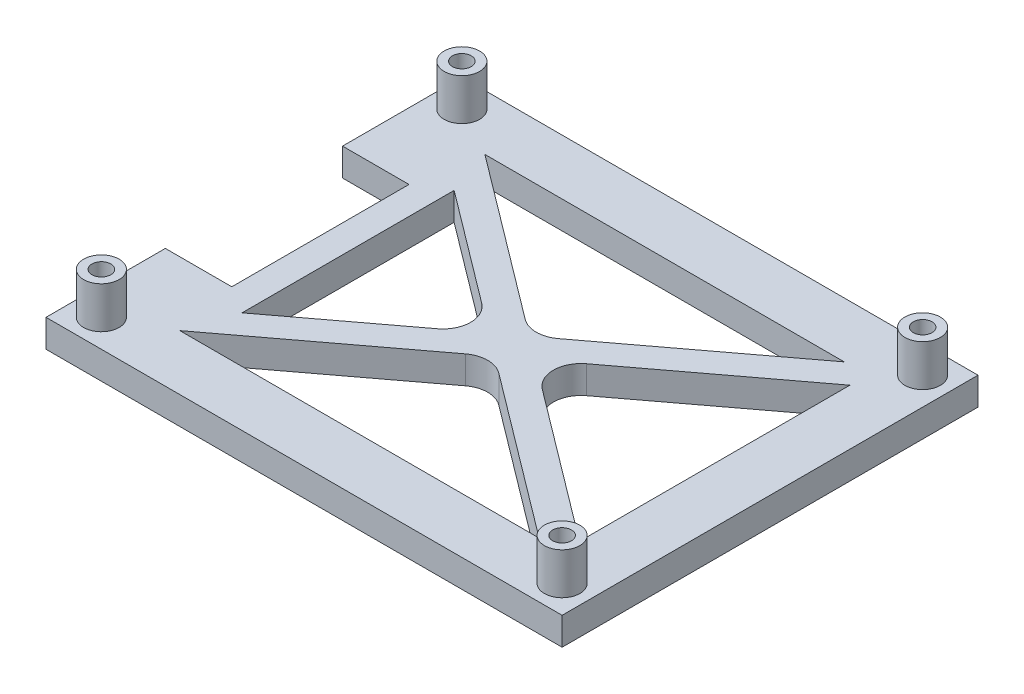
ISO-10303-21;
HEADER;
FILE_DESCRIPTION(('STEP AP214'),'2;1');
FILE_NAME('part.step','',(''),(''),'','','');
FILE_SCHEMA(('AUTOMOTIVE_DESIGN { 1 0 10303 214 1 1 1 1 }'));
ENDSEC;
DATA;
#1=APPLICATION_CONTEXT('core data for automotive mechanical design processes');
#2=APPLICATION_PROTOCOL_DEFINITION('international standard','automotive_design',2000,#1);
#3=PRODUCT_CONTEXT('',#1,'mechanical');
#4=PRODUCT('Part','Part','',(#3));
#5=PRODUCT_RELATED_PRODUCT_CATEGORY('part','',(#4));
#6=PRODUCT_DEFINITION_FORMATION('','',#4);
#7=PRODUCT_DEFINITION_CONTEXT('part definition',#1,'design');
#8=PRODUCT_DEFINITION('design','',#6,#7);
#9=PRODUCT_DEFINITION_SHAPE('','',#8);
#10=(LENGTH_UNIT() NAMED_UNIT(*) SI_UNIT(.MILLI.,.METRE.));
#11=(NAMED_UNIT(*) PLANE_ANGLE_UNIT() SI_UNIT($,.RADIAN.));
#12=(NAMED_UNIT(*) SI_UNIT($,.STERADIAN.) SOLID_ANGLE_UNIT());
#13=UNCERTAINTY_MEASURE_WITH_UNIT(LENGTH_MEASURE(1.E-05),#10,'distance_accuracy_value','');
#14=(GEOMETRIC_REPRESENTATION_CONTEXT(3) GLOBAL_UNCERTAINTY_ASSIGNED_CONTEXT((#13)) GLOBAL_UNIT_ASSIGNED_CONTEXT((#10,
#11,#12)) REPRESENTATION_CONTEXT('',''));
#15=CARTESIAN_POINT('',(0.,0.,0.));
#16=DIRECTION('',(0.,0.,1.));
#17=DIRECTION('',(1.,0.,0.));
#18=AXIS2_PLACEMENT_3D('',#15,#16,#17);
#19=CARTESIAN_POINT('',(-46.6,5.,0.));
#20=DIRECTION('',(-1.,0.,0.));
#21=DIRECTION('',(0.,0.,1.));
#22=AXIS2_PLACEMENT_3D('',#19,#20,#21);
#23=PLANE('',#22);
#24=DIRECTION('',(0.,1.,0.));
#25=VECTOR('',#24,1.);
#26=CARTESIAN_POINT('',(-46.6,0.,-16.));
#27=LINE('',#26,#25);
#28=CARTESIAN_POINT('',(-46.6,0.,-16.));
#29=VERTEX_POINT('',#28);
#30=CARTESIAN_POINT('',(-46.6,5.,-16.));
#31=VERTEX_POINT('',#30);
#32=EDGE_CURVE('E253',#29,#31,#27,.T.);
#33=ORIENTED_EDGE('',*,*,#32,.T.);
#34=DIRECTION('',(0.,0.,-1.));
#35=VECTOR('',#34,1.);
#36=CARTESIAN_POINT('',(-46.6,5.,0.));
#37=LINE('',#36,#35);
#38=CARTESIAN_POINT('',(-46.6,5.,-37.55));
#39=VERTEX_POINT('',#38);
#40=EDGE_CURVE('E217',#31,#39,#37,.T.);
#41=ORIENTED_EDGE('',*,*,#40,.T.);
#42=DIRECTION('',(0.,-1.,0.));
#43=VECTOR('',#42,1.);
#44=CARTESIAN_POINT('',(-46.6,5.,-37.55));
#45=LINE('',#44,#43);
#46=CARTESIAN_POINT('',(-46.6,0.,-37.55));
#47=VERTEX_POINT('',#46);
#48=EDGE_CURVE('E390',#39,#47,#45,.T.);
#49=ORIENTED_EDGE('',*,*,#48,.T.);
#50=DIRECTION('',(0.,0.,-1.));
#51=VECTOR('',#50,1.);
#52=CARTESIAN_POINT('',(-46.6,0.,0.));
#53=LINE('',#52,#51);
#54=EDGE_CURVE('E370',#29,#47,#53,.T.);
#55=ORIENTED_EDGE('',*,*,#54,.F.);
#56=EDGE_LOOP('',(#33,#41,#49,#55));
#57=FACE_BOUND('',#56,.T.);
#58=ADVANCED_FACE('F49',(#57),#23,.T.);
#59=CARTESIAN_POINT('',(0.,5.,0.));
#60=DIRECTION('',(0.,1.,0.));
#61=DIRECTION('',(0.,0.,1.));
#62=AXIS2_PLACEMENT_3D('',#59,#60,#61);
#63=PLANE('',#62);
#64=DIRECTION('',(0.798950975558303,0.,-0.601396157831455));
#65=VECTOR('',#64,1.);
#66=CARTESIAN_POINT('',(-1.50349039457863,5.,-1.99737743889575));
#67=LINE('',#66,#65);
#68=CARTESIAN_POINT('',(-29.6,5.,19.1517711848572));
#69=VERTEX_POINT('',#68);
#70=CARTESIAN_POINT('',(-9.4640001147512,5.,3.99475487779152));
#71=VERTEX_POINT('',#70);
#72=EDGE_CURVE('E309',#69,#71,#67,.T.);
#73=ORIENTED_EDGE('',*,*,#72,.F.);
#74=DIRECTION('',(0.,0.,-1.));
#75=VECTOR('',#74,1.);
#76=CARTESIAN_POINT('',(-29.6,5.,19.1517711848572));
#77=LINE('',#76,#75);
#78=CARTESIAN_POINT('',(-29.6,5.,-19.1517711848572));
#79=VERTEX_POINT('',#78);
#80=EDGE_CURVE('E232',#69,#79,#77,.T.);
#81=ORIENTED_EDGE('',*,*,#80,.T.);
#82=DIRECTION('',(0.798950975558303,0.,0.601396157831455));
#83=VECTOR('',#82,1.);
#84=CARTESIAN_POINT('',(-1.50349039457863,5.,1.99737743889575));
#85=LINE('',#84,#83);
#86=CARTESIAN_POINT('',(-9.4640001147512,5.,-3.99475487779152));
#87=VERTEX_POINT('',#86);
#88=EDGE_CURVE('E311',#79,#87,#85,.T.);
#89=ORIENTED_EDGE('',*,*,#88,.T.);
#90=CARTESIAN_POINT('',(-12.4709809039085,5.,0.));
#91=DIRECTION('',(0.,1.,0.));
#92=DIRECTION('',(0.,0.,1.));
#93=AXIS2_PLACEMENT_3D('',#90,#91,#92);
#94=CIRCLE('',#93,5.);
#95=EDGE_CURVE('E11',#87,#71,#94,.F.);
#96=ORIENTED_EDGE('',*,*,#95,.T.);
#97=EDGE_LOOP('',(#73,#81,#89,#96));
#98=FACE_BOUND('',#97,.T.);
#99=DIRECTION('',(0.,0.,1.));
#100=VECTOR('',#99,1.);
#101=CARTESIAN_POINT('',(-34.6,5.,-16.));
#102=LINE('',#101,#100);
#103=CARTESIAN_POINT('',(-34.6,5.,-16.));
#104=VERTEX_POINT('',#103);
#105=CARTESIAN_POINT('',(-34.6,5.,16.));
#106=VERTEX_POINT('',#105);
#107=EDGE_CURVE('E215',#104,#106,#102,.T.);
#108=ORIENTED_EDGE('',*,*,#107,.T.);
#109=DIRECTION('',(1.,0.,0.));
#110=VECTOR('',#109,1.);
#111=CARTESIAN_POINT('',(-46.6,5.,16.));
#112=LINE('',#111,#110);
#113=CARTESIAN_POINT('',(-46.6,5.,16.));
#114=VERTEX_POINT('',#113);
#115=EDGE_CURVE('E221',#114,#106,#112,.T.);
#116=ORIENTED_EDGE('',*,*,#115,.F.);
#117=CARTESIAN_POINT('',(-46.6,5.,37.55));
#118=VERTEX_POINT('',#117);
#119=EDGE_CURVE('E321',#118,#114,#37,.T.);
#120=ORIENTED_EDGE('',*,*,#119,.F.);
#121=DIRECTION('',(-1.,0.,0.));
#122=VECTOR('',#121,1.);
#123=CARTESIAN_POINT('',(0.,5.,37.55));
#124=LINE('',#123,#122);
#125=CARTESIAN_POINT('',(46.6,5.,37.55));
#126=VERTEX_POINT('',#125);
#127=EDGE_CURVE('E313',#126,#118,#124,.T.);
#128=ORIENTED_EDGE('',*,*,#127,.F.);
#129=DIRECTION('',(0.,0.,-1.));
#130=VECTOR('',#129,1.);
#131=CARTESIAN_POINT('',(46.6,5.,0.));
#132=LINE('',#131,#130);
#133=CARTESIAN_POINT('',(46.6,5.,-37.55));
#134=VERTEX_POINT('',#133);
#135=EDGE_CURVE('E316',#126,#134,#132,.T.);
#136=ORIENTED_EDGE('',*,*,#135,.T.);
#137=DIRECTION('',(-1.,0.,0.));
#138=VECTOR('',#137,1.);
#139=CARTESIAN_POINT('',(0.,5.,-37.55));
#140=LINE('',#139,#138);
#141=EDGE_CURVE('E319',#134,#39,#140,.T.);
#142=ORIENTED_EDGE('',*,*,#141,.T.);
#143=ORIENTED_EDGE('',*,*,#40,.F.);
#144=DIRECTION('',(-1.,0.,0.));
#145=VECTOR('',#144,1.);
#146=CARTESIAN_POINT('',(-46.6,5.,-16.));
#147=LINE('',#146,#145);
#148=EDGE_CURVE('E209',#104,#31,#147,.T.);
#149=ORIENTED_EDGE('',*,*,#148,.F.);
#150=EDGE_LOOP('',(#108,#116,#120,#128,#136,#142,#143,#149));
#151=FACE_BOUND('',#150,.T.);
#152=CARTESIAN_POINT('',(41.6,5.,32.55));
#153=DIRECTION('',(0.,1.,0.));
#154=DIRECTION('',(0.,0.,1.));
#155=AXIS2_PLACEMENT_3D('',#152,#153,#154);
#156=CIRCLE('',#155,3.2);
#157=CARTESIAN_POINT('',(41.6,5.,35.75));
#158=VERTEX_POINT('',#157);
#159=EDGE_CURVE('E266',#158,#158,#156,.T.);
#160=ORIENTED_EDGE('',*,*,#159,.F.);
#161=EDGE_LOOP('',(#160));
#162=FACE_BOUND('',#161,.T.);
#163=CARTESIAN_POINT('',(-41.6,5.,-32.55));
#164=DIRECTION('',(0.,1.,0.));
#165=DIRECTION('',(0.,0.,1.));
#166=AXIS2_PLACEMENT_3D('',#163,#164,#165);
#167=CIRCLE('',#166,3.2);
#168=CARTESIAN_POINT('',(-41.6,5.,-29.35));
#169=VERTEX_POINT('',#168);
#170=EDGE_CURVE('E286',#169,#169,#167,.T.);
#171=ORIENTED_EDGE('',*,*,#170,.F.);
#172=EDGE_LOOP('',(#171));
#173=FACE_BOUND('',#172,.T.);
#174=DIRECTION('',(0.798950975558303,0.,-0.601396157831455));
#175=VECTOR('',#174,1.);
#176=CARTESIAN_POINT('',(-1.50349039457863,5.,-1.99737743889575));
#177=LINE('',#176,#175);
#178=CARTESIAN_POINT('',(3.00698078915729,5.,-5.39255451845654));
#179=VERTEX_POINT('',#178);
#180=CARTESIAN_POINT('',(32.4430063653638,5.,-27.55));
#181=VERTEX_POINT('',#180);
#182=EDGE_CURVE('E293',#179,#181,#177,.T.);
#183=ORIENTED_EDGE('',*,*,#182,.F.);
#184=CARTESIAN_POINT('',(0.,5.,-9.38730939624805));
#185=DIRECTION('',(0.,1.,0.));
#186=DIRECTION('',(0.,0.,1.));
#187=AXIS2_PLACEMENT_3D('',#184,#185,#186);
#188=CIRCLE('',#187,5.);
#189=CARTESIAN_POINT('',(-3.00698078915725,5.,-5.39255451845654));
#190=VERTEX_POINT('',#189);
#191=EDGE_CURVE('E428',#179,#190,#188,.F.);
#192=ORIENTED_EDGE('',*,*,#191,.T.);
#193=DIRECTION('',(0.798950975558303,0.,0.601396157831455));
#194=VECTOR('',#193,1.);
#195=CARTESIAN_POINT('',(1.50349039457865,5.,-1.99737743889577));
#196=LINE('',#195,#194);
#197=CARTESIAN_POINT('',(-32.4430063653638,5.,-27.55));
#198=VERTEX_POINT('',#197);
#199=EDGE_CURVE('E295',#198,#190,#196,.T.);
#200=ORIENTED_EDGE('',*,*,#199,.F.);
#201=DIRECTION('',(-1.,0.,0.));
#202=VECTOR('',#201,1.);
#203=CARTESIAN_POINT('',(0.,5.,-27.55));
#204=LINE('',#203,#202);
#205=EDGE_CURVE('E299',#181,#198,#204,.T.);
#206=ORIENTED_EDGE('',*,*,#205,.F.);
#207=EDGE_LOOP('',(#183,#192,#200,#206));
#208=FACE_BOUND('',#207,.T.);
#209=DIRECTION('',(0.798950975558303,0.,0.601396157831455));
#210=VECTOR('',#209,1.);
#211=CARTESIAN_POINT('',(1.50349039457864,5.,-1.99737743889577));
#212=LINE('',#211,#210);
#213=CARTESIAN_POINT('',(9.46400011475122,5.,3.99475487779152));
#214=VERTEX_POINT('',#213);
#215=CARTESIAN_POINT('',(36.6,5.,24.4208968679173));
#216=VERTEX_POINT('',#215);
#217=EDGE_CURVE('E302',#214,#216,#212,.T.);
#218=ORIENTED_EDGE('',*,*,#217,.F.);
#219=CARTESIAN_POINT('',(12.4709809039085,5.,0.));
#220=DIRECTION('',(0.,1.,0.));
#221=DIRECTION('',(0.,0.,1.));
#222=AXIS2_PLACEMENT_3D('',#219,#220,#221);
#223=CIRCLE('',#222,5.);
#224=CARTESIAN_POINT('',(9.46400011475122,5.,-3.99475487779152));
#225=VERTEX_POINT('',#224);
#226=EDGE_CURVE('E436',#214,#225,#223,.F.);
#227=ORIENTED_EDGE('',*,*,#226,.T.);
#228=DIRECTION('',(0.798950975558303,0.,-0.601396157831455));
#229=VECTOR('',#228,1.);
#230=CARTESIAN_POINT('',(1.50349039457864,5.,1.99737743889576));
#231=LINE('',#230,#229);
#232=CARTESIAN_POINT('',(36.6,5.,-24.4208968679173));
#233=VERTEX_POINT('',#232);
#234=EDGE_CURVE('E304',#225,#233,#231,.T.);
#235=ORIENTED_EDGE('',*,*,#234,.T.);
#236=DIRECTION('',(0.,0.,-1.));
#237=VECTOR('',#236,1.);
#238=CARTESIAN_POINT('',(36.6,5.,0.));
#239=LINE('',#238,#237);
#240=EDGE_CURVE('E306',#216,#233,#239,.T.);
#241=ORIENTED_EDGE('',*,*,#240,.F.);
#242=EDGE_LOOP('',(#218,#227,#235,#241));
#243=FACE_BOUND('',#242,.T.);
#244=DIRECTION('',(0.798950975558303,0.,-0.601396157831455));
#245=VECTOR('',#244,1.);
#246=CARTESIAN_POINT('',(1.50349039457864,5.,1.99737743889576));
#247=LINE('',#246,#245);
#248=CARTESIAN_POINT('',(-32.4430063653638,5.,27.55));
#249=VERTEX_POINT('',#248);
#250=CARTESIAN_POINT('',(-3.00698078915727,5.,5.39255451845653));
#251=VERTEX_POINT('',#250);
#252=EDGE_CURVE('E324',#249,#251,#247,.T.);
#253=ORIENTED_EDGE('',*,*,#252,.T.);
#254=CARTESIAN_POINT('',(0.,5.,9.38730939624804));
#255=DIRECTION('',(0.,1.,0.));
#256=DIRECTION('',(0.,0.,1.));
#257=AXIS2_PLACEMENT_3D('',#254,#255,#256);
#258=CIRCLE('',#257,5.);
#259=CARTESIAN_POINT('',(3.00698078915728,5.,5.39255451845653));
#260=VERTEX_POINT('',#259);
#261=EDGE_CURVE('E432',#251,#260,#258,.F.);
#262=ORIENTED_EDGE('',*,*,#261,.T.);
#263=DIRECTION('',(0.798950975558303,0.,0.601396157831455));
#264=VECTOR('',#263,1.);
#265=CARTESIAN_POINT('',(-1.50349039457863,5.,1.99737743889576));
#266=LINE('',#265,#264);
#267=CARTESIAN_POINT('',(32.4430063653639,5.,27.55));
#268=VERTEX_POINT('',#267);
#269=EDGE_CURVE('E327',#260,#268,#266,.T.);
#270=ORIENTED_EDGE('',*,*,#269,.T.);
#271=DIRECTION('',(-1.,0.,0.));
#272=VECTOR('',#271,1.);
#273=CARTESIAN_POINT('',(0.,5.,27.55));
#274=LINE('',#273,#272);
#275=EDGE_CURVE('E329',#268,#249,#274,.T.);
#276=ORIENTED_EDGE('',*,*,#275,.T.);
#277=EDGE_LOOP('',(#253,#262,#270,#276));
#278=FACE_BOUND('',#277,.T.);
#279=CARTESIAN_POINT('',(41.6,5.,-32.55));
#280=DIRECTION('',(0.,1.,0.));
#281=DIRECTION('',(0.,0.,1.));
#282=AXIS2_PLACEMENT_3D('',#279,#280,#281);
#283=CIRCLE('',#282,3.2);
#284=CARTESIAN_POINT('',(41.6,5.,-29.35));
#285=VERTEX_POINT('',#284);
#286=EDGE_CURVE('E275',#285,#285,#283,.T.);
#287=ORIENTED_EDGE('',*,*,#286,.F.);
#288=EDGE_LOOP('',(#287));
#289=FACE_BOUND('',#288,.T.);
#290=CARTESIAN_POINT('',(-41.6,5.,32.55));
#291=DIRECTION('',(0.,1.,0.));
#292=DIRECTION('',(0.,0.,1.));
#293=AXIS2_PLACEMENT_3D('',#290,#291,#292);
#294=CIRCLE('',#293,3.2);
#295=CARTESIAN_POINT('',(-41.6,5.,35.75));
#296=VERTEX_POINT('',#295);
#297=EDGE_CURVE('E257',#296,#296,#294,.T.);
#298=ORIENTED_EDGE('',*,*,#297,.F.);
#299=EDGE_LOOP('',(#298));
#300=FACE_BOUND('',#299,.T.);
#301=ADVANCED_FACE('F211',(#98,#151,#162,#173,#208,#243,#278,#289,#300),#63,.T.);
#302=CARTESIAN_POINT('',(1.50349039457864,5.,1.99737743889576));
#303=DIRECTION('',(-0.601396157831455,0.,-0.798950975558303));
#304=DIRECTION('',(-0.798950975558303,0.,0.601396157831455));
#305=AXIS2_PLACEMENT_3D('',#302,#303,#304);
#306=PLANE('',#305);
#307=DIRECTION('',(0.798950975558303,0.,-0.601396157831455));
#308=VECTOR('',#307,1.);
#309=CARTESIAN_POINT('',(1.50349039457864,0.,1.99737743889576));
#310=LINE('',#309,#308);
#311=CARTESIAN_POINT('',(-32.4430063653638,0.,27.55));
#312=VERTEX_POINT('',#311);
#313=CARTESIAN_POINT('',(-3.00698078915727,0.,5.39255451845653));
#314=VERTEX_POINT('',#313);
#315=EDGE_CURVE('E374',#312,#314,#310,.T.);
#316=ORIENTED_EDGE('',*,*,#315,.T.);
#317=DIRECTION('',(0.,-1.,0.));
#318=VECTOR('',#317,1.);
#319=CARTESIAN_POINT('',(-3.00698078915727,5.,5.39255451845653));
#320=LINE('',#319,#318);
#321=EDGE_CURVE('E414',#314,#251,#320,.F.);
#322=ORIENTED_EDGE('',*,*,#321,.T.);
#323=ORIENTED_EDGE('',*,*,#252,.F.);
#324=DIRECTION('',(0.,-1.,0.));
#325=VECTOR('',#324,1.);
#326=CARTESIAN_POINT('',(-32.4430063653638,5.,27.55));
#327=LINE('',#326,#325);
#328=EDGE_CURVE('E380',#249,#312,#327,.T.);
#329=ORIENTED_EDGE('',*,*,#328,.T.);
#330=EDGE_LOOP('',(#316,#322,#323,#329));
#331=FACE_BOUND('',#330,.T.);
#332=ADVANCED_FACE('F482',(#331),#306,.F.);
#333=CARTESIAN_POINT('',(-1.50349039457863,5.,1.99737743889576));
#334=DIRECTION('',(0.601396157831455,0.,-0.798950975558303));
#335=DIRECTION('',(-0.798950975558303,0.,-0.601396157831455));
#336=AXIS2_PLACEMENT_3D('',#333,#334,#335);
#337=PLANE('',#336);
#338=ORIENTED_EDGE('',*,*,#269,.F.);
#339=DIRECTION('',(0.,-1.,0.));
#340=VECTOR('',#339,1.);
#341=CARTESIAN_POINT('',(3.00698078915728,0.,5.39255451845653));
#342=LINE('',#341,#340);
#343=CARTESIAN_POINT('',(3.00698078915728,0.,5.39255451845653));
#344=VERTEX_POINT('',#343);
#345=EDGE_CURVE('E411',#260,#344,#342,.T.);
#346=ORIENTED_EDGE('',*,*,#345,.T.);
#347=DIRECTION('',(0.798950975558303,0.,0.601396157831455));
#348=VECTOR('',#347,1.);
#349=CARTESIAN_POINT('',(-1.50349039457863,0.,1.99737743889576));
#350=LINE('',#349,#348);
#351=CARTESIAN_POINT('',(32.4430063653639,0.,27.55));
#352=VERTEX_POINT('',#351);
#353=EDGE_CURVE('E377',#344,#352,#350,.T.);
#354=ORIENTED_EDGE('',*,*,#353,.T.);
#355=DIRECTION('',(0.,-1.,0.));
#356=VECTOR('',#355,1.);
#357=CARTESIAN_POINT('',(32.4430063653639,5.,27.55));
#358=LINE('',#357,#356);
#359=EDGE_CURVE('E383',#268,#352,#358,.T.);
#360=ORIENTED_EDGE('',*,*,#359,.F.);
#361=EDGE_LOOP('',(#338,#346,#354,#360));
#362=FACE_BOUND('',#361,.T.);
#363=ADVANCED_FACE('F553',(#362),#337,.F.);
#364=CARTESIAN_POINT('',(0.,5.,37.55));
#365=DIRECTION('',(0.,0.,1.));
#366=DIRECTION('',(1.,0.,0.));
#367=AXIS2_PLACEMENT_3D('',#364,#365,#366);
#368=PLANE('',#367);
#369=DIRECTION('',(-1.,0.,0.));
#370=VECTOR('',#369,1.);
#371=CARTESIAN_POINT('',(0.,0.,37.55));
#372=LINE('',#371,#370);
#373=CARTESIAN_POINT('',(46.6,0.,37.55));
#374=VERTEX_POINT('',#373);
#375=CARTESIAN_POINT('',(-46.6,0.,37.55));
#376=VERTEX_POINT('',#375);
#377=EDGE_CURVE('E361',#374,#376,#372,.T.);
#378=ORIENTED_EDGE('',*,*,#377,.F.);
#379=DIRECTION('',(0.,-1.,0.));
#380=VECTOR('',#379,1.);
#381=CARTESIAN_POINT('',(46.6,5.,37.55));
#382=LINE('',#381,#380);
#383=EDGE_CURVE('E384',#126,#374,#382,.T.);
#384=ORIENTED_EDGE('',*,*,#383,.F.);
#385=ORIENTED_EDGE('',*,*,#127,.T.);
#386=DIRECTION('',(0.,-1.,0.));
#387=VECTOR('',#386,1.);
#388=CARTESIAN_POINT('',(-46.6,5.,37.55));
#389=LINE('',#388,#387);
#390=EDGE_CURVE('E388',#118,#376,#389,.T.);
#391=ORIENTED_EDGE('',*,*,#390,.T.);
#392=EDGE_LOOP('',(#378,#384,#385,#391));
#393=FACE_BOUND('',#392,.T.);
#394=ADVANCED_FACE('F502',(#393),#368,.T.);
#395=CARTESIAN_POINT('',(46.6,5.,0.));
#396=DIRECTION('',(-1.,0.,0.));
#397=DIRECTION('',(0.,0.,1.));
#398=AXIS2_PLACEMENT_3D('',#395,#396,#397);
#399=PLANE('',#398);
#400=DIRECTION('',(0.,0.,-1.));
#401=VECTOR('',#400,1.);
#402=CARTESIAN_POINT('',(46.6,0.,0.));
#403=LINE('',#402,#401);
#404=CARTESIAN_POINT('',(46.6,0.,-37.55));
#405=VERTEX_POINT('',#404);
#406=EDGE_CURVE('E364',#374,#405,#403,.T.);
#407=ORIENTED_EDGE('',*,*,#406,.T.);
#408=DIRECTION('',(0.,-1.,0.));
#409=VECTOR('',#408,1.);
#410=CARTESIAN_POINT('',(46.6,5.,-37.55));
#411=LINE('',#410,#409);
#412=EDGE_CURVE('E394',#134,#405,#411,.T.);
#413=ORIENTED_EDGE('',*,*,#412,.F.);
#414=ORIENTED_EDGE('',*,*,#135,.F.);
#415=ORIENTED_EDGE('',*,*,#383,.T.);
#416=EDGE_LOOP('',(#407,#413,#414,#415));
#417=FACE_BOUND('',#416,.T.);
#418=ADVANCED_FACE('F469',(#417),#399,.F.);
#419=CARTESIAN_POINT('',(0.,5.,-37.55));
#420=DIRECTION('',(0.,0.,1.));
#421=DIRECTION('',(1.,0.,0.));
#422=AXIS2_PLACEMENT_3D('',#419,#420,#421);
#423=PLANE('',#422);
#424=DIRECTION('',(-1.,0.,0.));
#425=VECTOR('',#424,1.);
#426=CARTESIAN_POINT('',(0.,0.,-37.55));
#427=LINE('',#426,#425);
#428=EDGE_CURVE('E367',#405,#47,#427,.T.);
#429=ORIENTED_EDGE('',*,*,#428,.T.);
#430=ORIENTED_EDGE('',*,*,#48,.F.);
#431=ORIENTED_EDGE('',*,*,#141,.F.);
#432=ORIENTED_EDGE('',*,*,#412,.T.);
#433=EDGE_LOOP('',(#429,#430,#431,#432));
#434=FACE_BOUND('',#433,.T.);
#435=ADVANCED_FACE('F458',(#434),#423,.F.);
#436=CARTESIAN_POINT('',(-1.50349039457863,5.,-1.99737743889575));
#437=DIRECTION('',(-0.601396157831455,0.,-0.798950975558303));
#438=DIRECTION('',(-0.798950975558303,0.,0.601396157831455));
#439=AXIS2_PLACEMENT_3D('',#436,#437,#438);
#440=PLANE('',#439);
#441=DIRECTION('',(0.,1.,0.));
#442=VECTOR('',#441,1.);
#443=CARTESIAN_POINT('',(-29.6,-49.3408635446707,19.1517711848572));
#444=LINE('',#443,#442);
#445=CARTESIAN_POINT('',(-29.6,0.,19.1517711848572));
#446=VERTEX_POINT('',#445);
#447=EDGE_CURVE('E64',#446,#69,#444,.T.);
#448=ORIENTED_EDGE('',*,*,#447,.T.);
#449=ORIENTED_EDGE('',*,*,#72,.T.);
#450=DIRECTION('',(0.,-1.,0.));
#451=VECTOR('',#450,1.);
#452=CARTESIAN_POINT('',(-9.4640001147512,5.,3.99475487779151));
#453=LINE('',#452,#451);
#454=CARTESIAN_POINT('',(-9.4640001147512,0.,3.99475487779152));
#455=VERTEX_POINT('',#454);
#456=EDGE_CURVE('E421',#71,#455,#453,.T.);
#457=ORIENTED_EDGE('',*,*,#456,.T.);
#458=DIRECTION('',(0.798950975558303,0.,-0.601396157831455));
#459=VECTOR('',#458,1.);
#460=CARTESIAN_POINT('',(-1.50349039457863,0.,-1.99737743889575));
#461=LINE('',#460,#459);
#462=EDGE_CURVE('E69',#446,#455,#461,.T.);
#463=ORIENTED_EDGE('',*,*,#462,.F.);
#464=EDGE_LOOP('',(#448,#449,#457,#463));
#465=FACE_BOUND('',#464,.T.);
#466=ADVANCED_FACE('F455',(#465),#440,.T.);
#467=CARTESIAN_POINT('',(1.50349039457864,5.,-1.99737743889577));
#468=DIRECTION('',(0.601396157831455,0.,-0.798950975558303));
#469=DIRECTION('',(-0.798950975558303,0.,-0.601396157831455));
#470=AXIS2_PLACEMENT_3D('',#467,#468,#469);
#471=PLANE('',#470);
#472=DIRECTION('',(0.798950975558303,0.,0.601396157831455));
#473=VECTOR('',#472,1.);
#474=CARTESIAN_POINT('',(1.50349039457864,0.,-1.99737743889577));
#475=LINE('',#474,#473);
#476=CARTESIAN_POINT('',(9.46400011475122,0.,3.99475487779152));
#477=VERTEX_POINT('',#476);
#478=CARTESIAN_POINT('',(36.6,0.,24.4208968679173));
#479=VERTEX_POINT('',#478);
#480=EDGE_CURVE('E351',#477,#479,#475,.T.);
#481=ORIENTED_EDGE('',*,*,#480,.F.);
#482=DIRECTION('',(0.,-1.,0.));
#483=VECTOR('',#482,1.);
#484=CARTESIAN_POINT('',(9.46400011475122,5.,3.99475487779151));
#485=LINE('',#484,#483);
#486=EDGE_CURVE('E419',#477,#214,#485,.F.);
#487=ORIENTED_EDGE('',*,*,#486,.T.);
#488=ORIENTED_EDGE('',*,*,#217,.T.);
#489=DIRECTION('',(0.,-1.,0.));
#490=VECTOR('',#489,1.);
#491=CARTESIAN_POINT('',(36.6,5.,24.4208968679173));
#492=LINE('',#491,#490);
#493=EDGE_CURVE('E398',#216,#479,#492,.T.);
#494=ORIENTED_EDGE('',*,*,#493,.T.);
#495=EDGE_LOOP('',(#481,#487,#488,#494));
#496=FACE_BOUND('',#495,.T.);
#497=ADVANCED_FACE('F457',(#496),#471,.T.);
#498=CARTESIAN_POINT('',(1.50349039457864,5.,1.99737743889576));
#499=DIRECTION('',(-0.601396157831455,0.,-0.798950975558303));
#500=DIRECTION('',(-0.798950975558303,0.,0.601396157831454));
#501=AXIS2_PLACEMENT_3D('',#498,#499,#500);
#502=PLANE('',#501);
#503=ORIENTED_EDGE('',*,*,#234,.F.);
#504=DIRECTION('',(0.,-1.,0.));
#505=VECTOR('',#504,1.);
#506=CARTESIAN_POINT('',(9.46400011475122,5.,-3.99475487779152));
#507=LINE('',#506,#505);
#508=CARTESIAN_POINT('',(9.46400011475122,0.,-3.99475487779152));
#509=VERTEX_POINT('',#508);
#510=EDGE_CURVE('E416',#225,#509,#507,.T.);
#511=ORIENTED_EDGE('',*,*,#510,.T.);
#512=DIRECTION('',(0.798950975558303,0.,-0.601396157831455));
#513=VECTOR('',#512,1.);
#514=CARTESIAN_POINT('',(1.50349039457864,0.,1.99737743889576));
#515=LINE('',#514,#513);
#516=CARTESIAN_POINT('',(36.6,0.,-24.4208968679173));
#517=VERTEX_POINT('',#516);
#518=EDGE_CURVE('E353',#509,#517,#515,.T.);
#519=ORIENTED_EDGE('',*,*,#518,.T.);
#520=DIRECTION('',(0.,-1.,0.));
#521=VECTOR('',#520,1.);
#522=CARTESIAN_POINT('',(36.6,5.,-24.4208968679173));
#523=LINE('',#522,#521);
#524=EDGE_CURVE('E391',#233,#517,#523,.T.);
#525=ORIENTED_EDGE('',*,*,#524,.F.);
#526=EDGE_LOOP('',(#503,#511,#519,#525));
#527=FACE_BOUND('',#526,.T.);
#528=ADVANCED_FACE('F465',(#527),#502,.F.);
#529=CARTESIAN_POINT('',(-1.50349039457863,5.,-1.99737743889575));
#530=DIRECTION('',(-0.601396157831455,0.,-0.798950975558303));
#531=DIRECTION('',(-0.798950975558303,0.,0.601396157831455));
#532=AXIS2_PLACEMENT_3D('',#529,#530,#531);
#533=PLANE('',#532);
#534=DIRECTION('',(0.798950975558303,0.,-0.601396157831455));
#535=VECTOR('',#534,1.);
#536=CARTESIAN_POINT('',(-1.50349039457863,0.,-1.99737743889575));
#537=LINE('',#536,#535);
#538=CARTESIAN_POINT('',(3.00698078915729,0.,-5.39255451845654));
#539=VERTEX_POINT('',#538);
#540=CARTESIAN_POINT('',(32.4430063653638,0.,-27.55));
#541=VERTEX_POINT('',#540);
#542=EDGE_CURVE('E343',#539,#541,#537,.T.);
#543=ORIENTED_EDGE('',*,*,#542,.F.);
#544=DIRECTION('',(0.,-1.,0.));
#545=VECTOR('',#544,1.);
#546=CARTESIAN_POINT('',(3.00698078915729,5.,-5.39255451845654));
#547=LINE('',#546,#545);
#548=EDGE_CURVE('E409',#539,#179,#547,.F.);
#549=ORIENTED_EDGE('',*,*,#548,.T.);
#550=ORIENTED_EDGE('',*,*,#182,.T.);
#551=DIRECTION('',(0.,-1.,0.));
#552=VECTOR('',#551,1.);
#553=CARTESIAN_POINT('',(32.4430063653638,5.,-27.55));
#554=LINE('',#553,#552);
#555=EDGE_CURVE('E331',#181,#541,#554,.T.);
#556=ORIENTED_EDGE('',*,*,#555,.T.);
#557=EDGE_LOOP('',(#543,#549,#550,#556));
#558=FACE_BOUND('',#557,.T.);
#559=ADVANCED_FACE('F491',(#558),#533,.T.);
#560=CARTESIAN_POINT('',(1.50349039457865,5.,-1.99737743889577));
#561=DIRECTION('',(0.601396157831455,0.,-0.798950975558303));
#562=DIRECTION('',(-0.798950975558303,0.,-0.601396157831455));
#563=AXIS2_PLACEMENT_3D('',#560,#561,#562);
#564=PLANE('',#563);
#565=ORIENTED_EDGE('',*,*,#199,.T.);
#566=DIRECTION('',(0.,-1.,0.));
#567=VECTOR('',#566,1.);
#568=CARTESIAN_POINT('',(-3.00698078915726,0.,-5.39255451845654));
#569=LINE('',#568,#567);
#570=CARTESIAN_POINT('',(-3.00698078915725,0.,-5.39255451845654));
#571=VERTEX_POINT('',#570);
#572=EDGE_CURVE('E387',#190,#571,#569,.T.);
#573=ORIENTED_EDGE('',*,*,#572,.T.);
#574=DIRECTION('',(0.798950975558303,0.,0.601396157831455));
#575=VECTOR('',#574,1.);
#576=CARTESIAN_POINT('',(1.50349039457865,0.,-1.99737743889577));
#577=LINE('',#576,#575);
#578=CARTESIAN_POINT('',(-32.4430063653638,0.,-27.55));
#579=VERTEX_POINT('',#578);
#580=EDGE_CURVE('E345',#579,#571,#577,.T.);
#581=ORIENTED_EDGE('',*,*,#580,.F.);
#582=DIRECTION('',(0.,-1.,0.));
#583=VECTOR('',#582,1.);
#584=CARTESIAN_POINT('',(-32.4430063653638,5.,-27.55));
#585=LINE('',#584,#583);
#586=EDGE_CURVE('E401',#198,#579,#585,.T.);
#587=ORIENTED_EDGE('',*,*,#586,.F.);
#588=EDGE_LOOP('',(#565,#573,#581,#587));
#589=FACE_BOUND('',#588,.T.);
#590=ADVANCED_FACE('F485',(#589),#564,.T.);
#591=DIRECTION('',(0.,1.,0.));
#592=VECTOR('',#591,1.);
#593=CARTESIAN_POINT('',(-46.6,0.,16.));
#594=LINE('',#593,#592);
#595=CARTESIAN_POINT('',(-46.6,0.,16.));
#596=VERTEX_POINT('',#595);
#597=EDGE_CURVE('E251',#596,#114,#594,.T.);
#598=ORIENTED_EDGE('',*,*,#597,.F.);
#599=EDGE_CURVE('E371',#376,#596,#53,.T.);
#600=ORIENTED_EDGE('',*,*,#599,.F.);
#601=ORIENTED_EDGE('',*,*,#390,.F.);
#602=ORIENTED_EDGE('',*,*,#119,.T.);
#603=EDGE_LOOP('',(#598,#600,#601,#602));
#604=FACE_BOUND('',#603,.T.);
#605=ADVANCED_FACE('F477',(#604),#23,.T.);
#606=CARTESIAN_POINT('',(-1.50349039457863,5.,1.99737743889575));
#607=DIRECTION('',(0.601396157831455,0.,-0.798950975558303));
#608=DIRECTION('',(-0.798950975558303,0.,-0.601396157831455));
#609=AXIS2_PLACEMENT_3D('',#606,#607,#608);
#610=PLANE('',#609);
#611=ORIENTED_EDGE('',*,*,#88,.F.);
#612=DIRECTION('',(0.,1.,0.));
#613=VECTOR('',#612,1.);
#614=CARTESIAN_POINT('',(-29.6,-49.3408635446707,-19.1517711848572));
#615=LINE('',#614,#613);
#616=CARTESIAN_POINT('',(-29.6,0.,-19.1517711848572));
#617=VERTEX_POINT('',#616);
#618=EDGE_CURVE('E244',#617,#79,#615,.T.);
#619=ORIENTED_EDGE('',*,*,#618,.F.);
#620=DIRECTION('',(0.798950975558303,0.,0.601396157831455));
#621=VECTOR('',#620,1.);
#622=CARTESIAN_POINT('',(-1.50349039457863,0.,1.99737743889575));
#623=LINE('',#622,#621);
#624=CARTESIAN_POINT('',(-9.4640001147512,0.,-3.99475487779152));
#625=VERTEX_POINT('',#624);
#626=EDGE_CURVE('E359',#617,#625,#623,.T.);
#627=ORIENTED_EDGE('',*,*,#626,.T.);
#628=DIRECTION('',(0.,-1.,0.));
#629=VECTOR('',#628,1.);
#630=CARTESIAN_POINT('',(-9.4640001147512,5.,-3.99475487779152));
#631=LINE('',#630,#629);
#632=EDGE_CURVE('E423',#625,#87,#631,.F.);
#633=ORIENTED_EDGE('',*,*,#632,.T.);
#634=EDGE_LOOP('',(#611,#619,#627,#633));
#635=FACE_BOUND('',#634,.T.);
#636=ADVANCED_FACE('F449',(#635),#610,.F.);
#637=CARTESIAN_POINT('',(36.6,5.,0.));
#638=DIRECTION('',(-1.,0.,0.));
#639=DIRECTION('',(0.,0.,1.));
#640=AXIS2_PLACEMENT_3D('',#637,#638,#639);
#641=PLANE('',#640);
#642=DIRECTION('',(0.,0.,-1.));
#643=VECTOR('',#642,1.);
#644=CARTESIAN_POINT('',(36.6,0.,0.));
#645=LINE('',#644,#643);
#646=EDGE_CURVE('E355',#479,#517,#645,.T.);
#647=ORIENTED_EDGE('',*,*,#646,.F.);
#648=ORIENTED_EDGE('',*,*,#493,.F.);
#649=ORIENTED_EDGE('',*,*,#240,.T.);
#650=ORIENTED_EDGE('',*,*,#524,.T.);
#651=EDGE_LOOP('',(#647,#648,#649,#650));
#652=FACE_BOUND('',#651,.T.);
#653=ADVANCED_FACE('F489',(#652),#641,.T.);
#654=CARTESIAN_POINT('',(0.,5.,-27.55));
#655=DIRECTION('',(0.,0.,1.));
#656=DIRECTION('',(1.,0.,0.));
#657=AXIS2_PLACEMENT_3D('',#654,#655,#656);
#658=PLANE('',#657);
#659=DIRECTION('',(-1.,0.,0.));
#660=VECTOR('',#659,1.);
#661=CARTESIAN_POINT('',(0.,0.,-27.55));
#662=LINE('',#661,#660);
#663=EDGE_CURVE('E348',#541,#579,#662,.T.);
#664=ORIENTED_EDGE('',*,*,#663,.F.);
#665=ORIENTED_EDGE('',*,*,#555,.F.);
#666=ORIENTED_EDGE('',*,*,#205,.T.);
#667=ORIENTED_EDGE('',*,*,#586,.T.);
#668=EDGE_LOOP('',(#664,#665,#666,#667));
#669=FACE_BOUND('',#668,.T.);
#670=ADVANCED_FACE('F606',(#669),#658,.T.);
#671=CARTESIAN_POINT('',(-41.6,5.,-32.55));
#672=DIRECTION('',(0.,-1.,0.));
#673=DIRECTION('',(0.,0.,-1.));
#674=AXIS2_PLACEMENT_3D('',#671,#672,#673);
#675=CYLINDRICAL_SURFACE('',#674,1.7);
#676=CARTESIAN_POINT('',(-41.6,0.,-32.55));
#677=DIRECTION('',(0.,1.,0.));
#678=DIRECTION('',(0.,0.,1.));
#679=AXIS2_PLACEMENT_3D('',#676,#677,#678);
#680=CIRCLE('',#679,1.7);
#681=CARTESIAN_POINT('',(-41.6,0.,-30.85));
#682=VERTEX_POINT('',#681);
#683=EDGE_CURVE('E340',#682,#682,#680,.T.);
#684=ORIENTED_EDGE('',*,*,#683,.F.);
#685=EDGE_LOOP('',(#684));
#686=FACE_BOUND('',#685,.T.);
#687=CARTESIAN_POINT('',(-41.6,12.5,-32.55));
#688=DIRECTION('',(0.,1.,0.));
#689=DIRECTION('',(0.,0.,1.));
#690=AXIS2_PLACEMENT_3D('',#687,#688,#689);
#691=CIRCLE('',#690,1.7);
#692=CARTESIAN_POINT('',(-41.6,12.5,-30.85));
#693=VERTEX_POINT('',#692);
#694=EDGE_CURVE('E283',#693,#693,#691,.T.);
#695=ORIENTED_EDGE('',*,*,#694,.T.);
#696=EDGE_LOOP('',(#695));
#697=FACE_BOUND('',#696,.T.);
#698=ADVANCED_FACE('F602',(#686,#697),#675,.F.);
#699=CARTESIAN_POINT('',(41.6,5.,-32.55));
#700=DIRECTION('',(0.,-1.,0.));
#701=DIRECTION('',(0.,0.,-1.));
#702=AXIS2_PLACEMENT_3D('',#699,#700,#701);
#703=CYLINDRICAL_SURFACE('',#702,1.7);
#704=CARTESIAN_POINT('',(41.6,0.,-32.55));
#705=DIRECTION('',(0.,1.,0.));
#706=DIRECTION('',(0.,0.,1.));
#707=AXIS2_PLACEMENT_3D('',#704,#705,#706);
#708=CIRCLE('',#707,1.7);
#709=CARTESIAN_POINT('',(41.6,0.,-30.85));
#710=VERTEX_POINT('',#709);
#711=EDGE_CURVE('E337',#710,#710,#708,.T.);
#712=ORIENTED_EDGE('',*,*,#711,.F.);
#713=EDGE_LOOP('',(#712));
#714=FACE_BOUND('',#713,.T.);
#715=CARTESIAN_POINT('',(41.6,12.5,-32.55));
#716=DIRECTION('',(0.,1.,0.));
#717=DIRECTION('',(0.,0.,1.));
#718=AXIS2_PLACEMENT_3D('',#715,#716,#717);
#719=CIRCLE('',#718,1.7);
#720=CARTESIAN_POINT('',(41.6,12.5,-30.85));
#721=VERTEX_POINT('',#720);
#722=EDGE_CURVE('E278',#721,#721,#719,.T.);
#723=ORIENTED_EDGE('',*,*,#722,.T.);
#724=EDGE_LOOP('',(#723));
#725=FACE_BOUND('',#724,.T.);
#726=ADVANCED_FACE('F598',(#714,#725),#703,.F.);
#727=CARTESIAN_POINT('',(41.6,5.,32.55));
#728=DIRECTION('',(0.,-1.,0.));
#729=DIRECTION('',(0.,0.,-1.));
#730=AXIS2_PLACEMENT_3D('',#727,#728,#729);
#731=CYLINDRICAL_SURFACE('',#730,1.7);
#732=CARTESIAN_POINT('',(41.6,0.,32.55));
#733=DIRECTION('',(0.,1.,0.));
#734=DIRECTION('',(0.,0.,1.));
#735=AXIS2_PLACEMENT_3D('',#732,#733,#734);
#736=CIRCLE('',#735,1.7);
#737=CARTESIAN_POINT('',(41.6,0.,34.25));
#738=VERTEX_POINT('',#737);
#739=EDGE_CURVE('E334',#738,#738,#736,.T.);
#740=ORIENTED_EDGE('',*,*,#739,.F.);
#741=EDGE_LOOP('',(#740));
#742=FACE_BOUND('',#741,.T.);
#743=CARTESIAN_POINT('',(41.6,12.5,32.55));
#744=DIRECTION('',(0.,1.,0.));
#745=DIRECTION('',(0.,0.,1.));
#746=AXIS2_PLACEMENT_3D('',#743,#744,#745);
#747=CIRCLE('',#746,1.7);
#748=CARTESIAN_POINT('',(41.6,12.5,34.25));
#749=VERTEX_POINT('',#748);
#750=EDGE_CURVE('E269',#749,#749,#747,.T.);
#751=ORIENTED_EDGE('',*,*,#750,.T.);
#752=EDGE_LOOP('',(#751));
#753=FACE_BOUND('',#752,.T.);
#754=ADVANCED_FACE('F594',(#742,#753),#731,.F.);
#755=CARTESIAN_POINT('',(-41.6,5.,32.55));
#756=DIRECTION('',(0.,-1.,0.));
#757=DIRECTION('',(0.,0.,-1.));
#758=AXIS2_PLACEMENT_3D('',#755,#756,#757);
#759=CYLINDRICAL_SURFACE('',#758,1.7);
#760=CARTESIAN_POINT('',(-41.6,0.,32.55));
#761=DIRECTION('',(0.,1.,0.));
#762=DIRECTION('',(0.,0.,1.));
#763=AXIS2_PLACEMENT_3D('',#760,#761,#762);
#764=CIRCLE('',#763,1.7);
#765=CARTESIAN_POINT('',(-41.6,0.,34.25));
#766=VERTEX_POINT('',#765);
#767=EDGE_CURVE('E290',#766,#766,#764,.T.);
#768=ORIENTED_EDGE('',*,*,#767,.F.);
#769=EDGE_LOOP('',(#768));
#770=FACE_BOUND('',#769,.T.);
#771=CARTESIAN_POINT('',(-41.6,12.5,32.55));
#772=DIRECTION('',(0.,1.,0.));
#773=DIRECTION('',(0.,0.,1.));
#774=AXIS2_PLACEMENT_3D('',#771,#772,#773);
#775=CIRCLE('',#774,1.7);
#776=CARTESIAN_POINT('',(-41.6,12.5,34.25));
#777=VERTEX_POINT('',#776);
#778=EDGE_CURVE('E260',#777,#777,#775,.T.);
#779=ORIENTED_EDGE('',*,*,#778,.T.);
#780=EDGE_LOOP('',(#779));
#781=FACE_BOUND('',#780,.T.);
#782=ADVANCED_FACE('F551',(#770,#781),#759,.F.);
#783=CARTESIAN_POINT('',(0.,5.,27.55));
#784=DIRECTION('',(0.,0.,1.));
#785=DIRECTION('',(1.,0.,0.));
#786=AXIS2_PLACEMENT_3D('',#783,#784,#785);
#787=PLANE('',#786);
#788=DIRECTION('',(-1.,0.,0.));
#789=VECTOR('',#788,1.);
#790=CARTESIAN_POINT('',(0.,0.,27.55));
#791=LINE('',#790,#789);
#792=EDGE_CURVE('E296',#352,#312,#791,.T.);
#793=ORIENTED_EDGE('',*,*,#792,.T.);
#794=ORIENTED_EDGE('',*,*,#328,.F.);
#795=ORIENTED_EDGE('',*,*,#275,.F.);
#796=ORIENTED_EDGE('',*,*,#359,.T.);
#797=EDGE_LOOP('',(#793,#794,#795,#796));
#798=FACE_BOUND('',#797,.T.);
#799=ADVANCED_FACE('F548',(#798),#787,.F.);
#800=CARTESIAN_POINT('',(0.,0.,0.));
#801=DIRECTION('',(0.,1.,0.));
#802=DIRECTION('',(0.,0.,1.));
#803=AXIS2_PLACEMENT_3D('',#800,#801,#802);
#804=PLANE('',#803);
#805=ORIENTED_EDGE('',*,*,#626,.F.);
#806=DIRECTION('',(0.,0.,1.));
#807=VECTOR('',#806,1.);
#808=CARTESIAN_POINT('',(-29.6,0.,19.1517711848572));
#809=LINE('',#808,#807);
#810=EDGE_CURVE('E241',#617,#446,#809,.T.);
#811=ORIENTED_EDGE('',*,*,#810,.T.);
#812=ORIENTED_EDGE('',*,*,#462,.T.);
#813=CARTESIAN_POINT('',(-12.4709809039085,0.,0.));
#814=DIRECTION('',(0.,1.,0.));
#815=DIRECTION('',(0.,0.,1.));
#816=AXIS2_PLACEMENT_3D('',#813,#814,#815);
#817=CIRCLE('',#816,5.);
#818=EDGE_CURVE('E57',#455,#625,#817,.T.);
#819=ORIENTED_EDGE('',*,*,#818,.T.);
#820=EDGE_LOOP('',(#805,#811,#812,#819));
#821=FACE_BOUND('',#820,.T.);
#822=DIRECTION('',(0.,0.,-1.));
#823=VECTOR('',#822,1.);
#824=CARTESIAN_POINT('',(-34.6,0.,-16.));
#825=LINE('',#824,#823);
#826=CARTESIAN_POINT('',(-34.6,0.,16.));
#827=VERTEX_POINT('',#826);
#828=CARTESIAN_POINT('',(-34.6,0.,-16.));
#829=VERTEX_POINT('',#828);
#830=EDGE_CURVE('E246',#827,#829,#825,.T.);
#831=ORIENTED_EDGE('',*,*,#830,.T.);
#832=DIRECTION('',(-1.,0.,0.));
#833=VECTOR('',#832,1.);
#834=CARTESIAN_POINT('',(-46.6,0.,-16.));
#835=LINE('',#834,#833);
#836=EDGE_CURVE('E227',#829,#29,#835,.T.);
#837=ORIENTED_EDGE('',*,*,#836,.T.);
#838=ORIENTED_EDGE('',*,*,#54,.T.);
#839=ORIENTED_EDGE('',*,*,#428,.F.);
#840=ORIENTED_EDGE('',*,*,#406,.F.);
#841=ORIENTED_EDGE('',*,*,#377,.T.);
#842=ORIENTED_EDGE('',*,*,#599,.T.);
#843=DIRECTION('',(1.,0.,0.));
#844=VECTOR('',#843,1.);
#845=CARTESIAN_POINT('',(-46.6,0.,16.));
#846=LINE('',#845,#844);
#847=EDGE_CURVE('E220',#596,#827,#846,.T.);
#848=ORIENTED_EDGE('',*,*,#847,.T.);
#849=EDGE_LOOP('',(#831,#837,#838,#839,#840,#841,#842,#848));
#850=FACE_BOUND('',#849,.T.);
#851=ORIENTED_EDGE('',*,*,#767,.T.);
#852=EDGE_LOOP('',(#851));
#853=FACE_BOUND('',#852,.T.);
#854=ORIENTED_EDGE('',*,*,#739,.T.);
#855=EDGE_LOOP('',(#854));
#856=FACE_BOUND('',#855,.T.);
#857=ORIENTED_EDGE('',*,*,#711,.T.);
#858=EDGE_LOOP('',(#857));
#859=FACE_BOUND('',#858,.T.);
#860=ORIENTED_EDGE('',*,*,#683,.T.);
#861=EDGE_LOOP('',(#860));
#862=FACE_BOUND('',#861,.T.);
#863=ORIENTED_EDGE('',*,*,#580,.T.);
#864=CARTESIAN_POINT('',(0.,0.,-9.38730939624805));
#865=DIRECTION('',(0.,1.,0.));
#866=DIRECTION('',(0.,0.,1.));
#867=AXIS2_PLACEMENT_3D('',#864,#865,#866);
#868=CIRCLE('',#867,5.);
#869=EDGE_CURVE('E426',#571,#539,#868,.T.);
#870=ORIENTED_EDGE('',*,*,#869,.T.);
#871=ORIENTED_EDGE('',*,*,#542,.T.);
#872=ORIENTED_EDGE('',*,*,#663,.T.);
#873=EDGE_LOOP('',(#863,#870,#871,#872));
#874=FACE_BOUND('',#873,.T.);
#875=ORIENTED_EDGE('',*,*,#518,.F.);
#876=CARTESIAN_POINT('',(12.4709809039085,0.,0.));
#877=DIRECTION('',(0.,1.,0.));
#878=DIRECTION('',(0.,0.,1.));
#879=AXIS2_PLACEMENT_3D('',#876,#877,#878);
#880=CIRCLE('',#879,5.);
#881=EDGE_CURVE('E434',#509,#477,#880,.T.);
#882=ORIENTED_EDGE('',*,*,#881,.T.);
#883=ORIENTED_EDGE('',*,*,#480,.T.);
#884=ORIENTED_EDGE('',*,*,#646,.T.);
#885=EDGE_LOOP('',(#875,#882,#883,#884));
#886=FACE_BOUND('',#885,.T.);
#887=ORIENTED_EDGE('',*,*,#315,.F.);
#888=ORIENTED_EDGE('',*,*,#792,.F.);
#889=ORIENTED_EDGE('',*,*,#353,.F.);
#890=CARTESIAN_POINT('',(0.,0.,9.38730939624804));
#891=DIRECTION('',(0.,1.,0.));
#892=DIRECTION('',(0.,0.,1.));
#893=AXIS2_PLACEMENT_3D('',#890,#891,#892);
#894=CIRCLE('',#893,5.);
#895=EDGE_CURVE('E430',#344,#314,#894,.T.);
#896=ORIENTED_EDGE('',*,*,#895,.T.);
#897=EDGE_LOOP('',(#887,#888,#889,#896));
#898=FACE_BOUND('',#897,.T.);
#899=ADVANCED_FACE('F442',(#821,#850,#853,#856,#859,#862,#874,#886,#898),#804,.F.);
#900=CARTESIAN_POINT('',(0.,5.,-9.38730939624805));
#901=DIRECTION('',(0.,1.,0.));
#902=DIRECTION('',(0.,0.,1.));
#903=AXIS2_PLACEMENT_3D('',#900,#901,#902);
#904=CYLINDRICAL_SURFACE('',#903,5.);
#905=ORIENTED_EDGE('',*,*,#191,.F.);
#906=ORIENTED_EDGE('',*,*,#548,.F.);
#907=ORIENTED_EDGE('',*,*,#869,.F.);
#908=ORIENTED_EDGE('',*,*,#572,.F.);
#909=EDGE_LOOP('',(#905,#906,#907,#908));
#910=FACE_BOUND('',#909,.T.);
#911=ADVANCED_FACE('F547',(#910),#904,.F.);
#912=CARTESIAN_POINT('',(0.,5.,9.38730939624804));
#913=DIRECTION('',(0.,1.,0.));
#914=DIRECTION('',(0.,0.,1.));
#915=AXIS2_PLACEMENT_3D('',#912,#913,#914);
#916=CYLINDRICAL_SURFACE('',#915,5.);
#917=ORIENTED_EDGE('',*,*,#261,.F.);
#918=ORIENTED_EDGE('',*,*,#321,.F.);
#919=ORIENTED_EDGE('',*,*,#895,.F.);
#920=ORIENTED_EDGE('',*,*,#345,.F.);
#921=EDGE_LOOP('',(#917,#918,#919,#920));
#922=FACE_BOUND('',#921,.T.);
#923=ADVANCED_FACE('F568',(#922),#916,.F.);
#924=CARTESIAN_POINT('',(12.4709809039085,5.,0.));
#925=DIRECTION('',(0.,-1.,0.));
#926=DIRECTION('',(0.,0.,-1.));
#927=AXIS2_PLACEMENT_3D('',#924,#925,#926);
#928=CYLINDRICAL_SURFACE('',#927,5.);
#929=ORIENTED_EDGE('',*,*,#226,.F.);
#930=ORIENTED_EDGE('',*,*,#486,.F.);
#931=ORIENTED_EDGE('',*,*,#881,.F.);
#932=ORIENTED_EDGE('',*,*,#510,.F.);
#933=EDGE_LOOP('',(#929,#930,#931,#932));
#934=FACE_BOUND('',#933,.T.);
#935=ADVANCED_FACE('F582',(#934),#928,.F.);
#936=CARTESIAN_POINT('',(-12.4709809039085,5.,0.));
#937=DIRECTION('',(0.,-1.,0.));
#938=DIRECTION('',(0.,0.,-1.));
#939=AXIS2_PLACEMENT_3D('',#936,#937,#938);
#940=CYLINDRICAL_SURFACE('',#939,5.);
#941=ORIENTED_EDGE('',*,*,#95,.F.);
#942=ORIENTED_EDGE('',*,*,#632,.F.);
#943=ORIENTED_EDGE('',*,*,#818,.F.);
#944=ORIENTED_EDGE('',*,*,#456,.F.);
#945=EDGE_LOOP('',(#941,#942,#943,#944));
#946=FACE_BOUND('',#945,.T.);
#947=ADVANCED_FACE('F51',(#946),#940,.F.);
#948=CARTESIAN_POINT('',(-41.6,12.5,-32.55));
#949=DIRECTION('',(0.,1.,0.));
#950=DIRECTION('',(0.,0.,1.));
#951=AXIS2_PLACEMENT_3D('',#948,#949,#950);
#952=PLANE('',#951);
#953=CARTESIAN_POINT('',(-41.6,12.5,-32.55));
#954=DIRECTION('',(0.,1.,0.));
#955=DIRECTION('',(0.,0.,1.));
#956=AXIS2_PLACEMENT_3D('',#953,#954,#955);
#957=CIRCLE('',#956,3.2);
#958=CARTESIAN_POINT('',(-41.6,12.5,-29.35));
#959=VERTEX_POINT('',#958);
#960=EDGE_CURVE('E287',#959,#959,#957,.T.);
#961=ORIENTED_EDGE('',*,*,#960,.T.);
#962=EDGE_LOOP('',(#961));
#963=FACE_BOUND('',#962,.T.);
#964=ORIENTED_EDGE('',*,*,#694,.F.);
#965=EDGE_LOOP('',(#964));
#966=FACE_BOUND('',#965,.T.);
#967=ADVANCED_FACE('F539',(#963,#966),#952,.T.);
#968=CARTESIAN_POINT('',(-41.6,12.5,-32.55));
#969=DIRECTION('',(0.,-1.,0.));
#970=DIRECTION('',(0.,0.,-1.));
#971=AXIS2_PLACEMENT_3D('',#968,#969,#970);
#972=CYLINDRICAL_SURFACE('',#971,3.2);
#973=ORIENTED_EDGE('',*,*,#960,.F.);
#974=EDGE_LOOP('',(#973));
#975=FACE_BOUND('',#974,.T.);
#976=ORIENTED_EDGE('',*,*,#170,.T.);
#977=EDGE_LOOP('',(#976));
#978=FACE_BOUND('',#977,.T.);
#979=ADVANCED_FACE('F537',(#975,#978),#972,.T.);
#980=CARTESIAN_POINT('',(41.6,12.5,-32.55));
#981=DIRECTION('',(0.,1.,0.));
#982=DIRECTION('',(0.,0.,1.));
#983=AXIS2_PLACEMENT_3D('',#980,#981,#982);
#984=PLANE('',#983);
#985=CARTESIAN_POINT('',(41.6,12.5,-32.55));
#986=DIRECTION('',(0.,1.,0.));
#987=DIRECTION('',(0.,0.,1.));
#988=AXIS2_PLACEMENT_3D('',#985,#986,#987);
#989=CIRCLE('',#988,3.2);
#990=CARTESIAN_POINT('',(41.6,12.5,-29.35));
#991=VERTEX_POINT('',#990);
#992=EDGE_CURVE('E274',#991,#991,#989,.T.);
#993=ORIENTED_EDGE('',*,*,#992,.T.);
#994=EDGE_LOOP('',(#993));
#995=FACE_BOUND('',#994,.T.);
#996=ORIENTED_EDGE('',*,*,#722,.F.);
#997=EDGE_LOOP('',(#996));
#998=FACE_BOUND('',#997,.T.);
#999=ADVANCED_FACE('F533',(#995,#998),#984,.T.);
#1000=CARTESIAN_POINT('',(41.6,12.5,-32.55));
#1001=DIRECTION('',(0.,-1.,0.));
#1002=DIRECTION('',(0.,0.,-1.));
#1003=AXIS2_PLACEMENT_3D('',#1000,#1001,#1002);
#1004=CYLINDRICAL_SURFACE('',#1003,3.2);
#1005=ORIENTED_EDGE('',*,*,#992,.F.);
#1006=EDGE_LOOP('',(#1005));
#1007=FACE_BOUND('',#1006,.T.);
#1008=ORIENTED_EDGE('',*,*,#286,.T.);
#1009=EDGE_LOOP('',(#1008));
#1010=FACE_BOUND('',#1009,.T.);
#1011=ADVANCED_FACE('F529',(#1007,#1010),#1004,.T.);
#1012=CARTESIAN_POINT('',(41.6,12.5,32.55));
#1013=DIRECTION('',(0.,1.,0.));
#1014=DIRECTION('',(0.,0.,1.));
#1015=AXIS2_PLACEMENT_3D('',#1012,#1013,#1014);
#1016=PLANE('',#1015);
#1017=CARTESIAN_POINT('',(41.6,12.5,32.55));
#1018=DIRECTION('',(0.,1.,0.));
#1019=DIRECTION('',(0.,0.,1.));
#1020=AXIS2_PLACEMENT_3D('',#1017,#1018,#1019);
#1021=CIRCLE('',#1020,3.2);
#1022=CARTESIAN_POINT('',(41.6,12.5,35.75));
#1023=VERTEX_POINT('',#1022);
#1024=EDGE_CURVE('E265',#1023,#1023,#1021,.T.);
#1025=ORIENTED_EDGE('',*,*,#1024,.T.);
#1026=EDGE_LOOP('',(#1025));
#1027=FACE_BOUND('',#1026,.T.);
#1028=ORIENTED_EDGE('',*,*,#750,.F.);
#1029=EDGE_LOOP('',(#1028));
#1030=FACE_BOUND('',#1029,.T.);
#1031=ADVANCED_FACE('F525',(#1027,#1030),#1016,.T.);
#1032=CARTESIAN_POINT('',(41.6,12.5,32.55));
#1033=DIRECTION('',(0.,-1.,0.));
#1034=DIRECTION('',(0.,0.,-1.));
#1035=AXIS2_PLACEMENT_3D('',#1032,#1033,#1034);
#1036=CYLINDRICAL_SURFACE('',#1035,3.2);
#1037=ORIENTED_EDGE('',*,*,#1024,.F.);
#1038=EDGE_LOOP('',(#1037));
#1039=FACE_BOUND('',#1038,.T.);
#1040=ORIENTED_EDGE('',*,*,#159,.T.);
#1041=EDGE_LOOP('',(#1040));
#1042=FACE_BOUND('',#1041,.T.);
#1043=ADVANCED_FACE('F521',(#1039,#1042),#1036,.T.);
#1044=CARTESIAN_POINT('',(-41.6,12.5,32.55));
#1045=DIRECTION('',(0.,1.,0.));
#1046=DIRECTION('',(0.,0.,1.));
#1047=AXIS2_PLACEMENT_3D('',#1044,#1045,#1046);
#1048=PLANE('',#1047);
#1049=CARTESIAN_POINT('',(-41.6,12.5,32.55));
#1050=DIRECTION('',(0.,1.,0.));
#1051=DIRECTION('',(0.,0.,1.));
#1052=AXIS2_PLACEMENT_3D('',#1049,#1050,#1051);
#1053=CIRCLE('',#1052,3.2);
#1054=CARTESIAN_POINT('',(-41.6,12.5,35.75));
#1055=VERTEX_POINT('',#1054);
#1056=EDGE_CURVE('E255',#1055,#1055,#1053,.T.);
#1057=ORIENTED_EDGE('',*,*,#1056,.T.);
#1058=EDGE_LOOP('',(#1057));
#1059=FACE_BOUND('',#1058,.T.);
#1060=ORIENTED_EDGE('',*,*,#778,.F.);
#1061=EDGE_LOOP('',(#1060));
#1062=FACE_BOUND('',#1061,.T.);
#1063=ADVANCED_FACE('F514',(#1059,#1062),#1048,.T.);
#1064=CARTESIAN_POINT('',(-41.6,12.5,32.55));
#1065=DIRECTION('',(0.,-1.,0.));
#1066=DIRECTION('',(0.,0.,-1.));
#1067=AXIS2_PLACEMENT_3D('',#1064,#1065,#1066);
#1068=CYLINDRICAL_SURFACE('',#1067,3.2);
#1069=ORIENTED_EDGE('',*,*,#1056,.F.);
#1070=EDGE_LOOP('',(#1069));
#1071=FACE_BOUND('',#1070,.T.);
#1072=ORIENTED_EDGE('',*,*,#297,.T.);
#1073=EDGE_LOOP('',(#1072));
#1074=FACE_BOUND('',#1073,.T.);
#1075=ADVANCED_FACE('F507',(#1071,#1074),#1068,.T.);
#1076=CARTESIAN_POINT('',(-46.6,0.,16.));
#1077=DIRECTION('',(0.,0.,1.));
#1078=DIRECTION('',(1.,0.,0.));
#1079=AXIS2_PLACEMENT_3D('',#1076,#1077,#1078);
#1080=PLANE('',#1079);
#1081=ORIENTED_EDGE('',*,*,#115,.T.);
#1082=DIRECTION('',(0.,1.,0.));
#1083=VECTOR('',#1082,1.);
#1084=CARTESIAN_POINT('',(-34.6,-49.3408635446707,16.));
#1085=LINE('',#1084,#1083);
#1086=EDGE_CURVE('E231',#827,#106,#1085,.T.);
#1087=ORIENTED_EDGE('',*,*,#1086,.F.);
#1088=ORIENTED_EDGE('',*,*,#847,.F.);
#1089=ORIENTED_EDGE('',*,*,#597,.T.);
#1090=EDGE_LOOP('',(#1081,#1087,#1088,#1089));
#1091=FACE_BOUND('',#1090,.T.);
#1092=ADVANCED_FACE('F505',(#1091),#1080,.F.);
#1093=CARTESIAN_POINT('',(-46.6,0.,-16.));
#1094=DIRECTION('',(0.,0.,-1.));
#1095=DIRECTION('',(-1.,0.,0.));
#1096=AXIS2_PLACEMENT_3D('',#1093,#1094,#1095);
#1097=PLANE('',#1096);
#1098=ORIENTED_EDGE('',*,*,#148,.T.);
#1099=ORIENTED_EDGE('',*,*,#32,.F.);
#1100=ORIENTED_EDGE('',*,*,#836,.F.);
#1101=DIRECTION('',(0.,1.,0.));
#1102=VECTOR('',#1101,1.);
#1103=CARTESIAN_POINT('',(-34.6,-49.3408635446707,-16.));
#1104=LINE('',#1103,#1102);
#1105=EDGE_CURVE('E224',#829,#104,#1104,.T.);
#1106=ORIENTED_EDGE('',*,*,#1105,.T.);
#1107=EDGE_LOOP('',(#1098,#1099,#1100,#1106));
#1108=FACE_BOUND('',#1107,.T.);
#1109=ADVANCED_FACE('F225',(#1108),#1097,.F.);
#1110=CARTESIAN_POINT('',(-29.6,-49.3408635446707,19.1517711848572));
#1111=DIRECTION('',(1.,0.,0.));
#1112=DIRECTION('',(0.,0.,-1.));
#1113=AXIS2_PLACEMENT_3D('',#1110,#1111,#1112);
#1114=PLANE('',#1113);
#1115=ORIENTED_EDGE('',*,*,#810,.F.);
#1116=ORIENTED_EDGE('',*,*,#618,.T.);
#1117=ORIENTED_EDGE('',*,*,#80,.F.);
#1118=ORIENTED_EDGE('',*,*,#447,.F.);
#1119=EDGE_LOOP('',(#1115,#1116,#1117,#1118));
#1120=FACE_BOUND('',#1119,.T.);
#1121=ADVANCED_FACE('F453',(#1120),#1114,.T.);
#1122=CARTESIAN_POINT('',(-34.6,-49.3408635446707,-16.));
#1123=DIRECTION('',(-1.,0.,0.));
#1124=DIRECTION('',(0.,0.,1.));
#1125=AXIS2_PLACEMENT_3D('',#1122,#1123,#1124);
#1126=PLANE('',#1125);
#1127=ORIENTED_EDGE('',*,*,#830,.F.);
#1128=ORIENTED_EDGE('',*,*,#1086,.T.);
#1129=ORIENTED_EDGE('',*,*,#107,.F.);
#1130=ORIENTED_EDGE('',*,*,#1105,.F.);
#1131=EDGE_LOOP('',(#1127,#1128,#1129,#1130));
#1132=FACE_BOUND('',#1131,.T.);
#1133=ADVANCED_FACE('F235',(#1132),#1126,.T.);
#1134=CLOSED_SHELL('',(#58,#301,#332,#363,#394,#418,#435,#466,#497,#528,#559,#590,#605,#636,
#653,#670,#698,#726,#754,#782,#799,#899,#911,#923,#935,#947,#967,#979,#999,#1011,#1031,#1043,
#1063,#1075,#1092,#1109,#1121,#1133));
#1135=MANIFOLD_SOLID_BREP('B2',#1134);
#1136=ADVANCED_BREP_SHAPE_REPRESENTATION('',(#18,#1135),#14);
#1137=SHAPE_DEFINITION_REPRESENTATION(#9,#1136);
ENDSEC;
END-ISO-10303-21;
